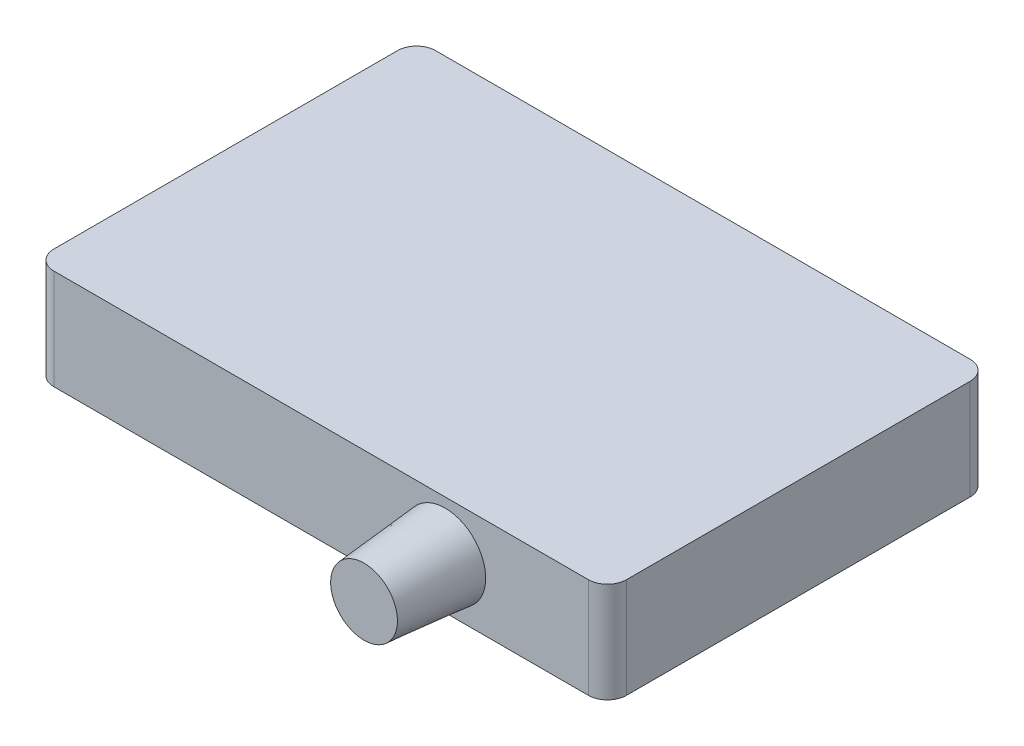
ISO-10303-21;
HEADER;
FILE_DESCRIPTION(('STEP AP214'),'2;1');
FILE_NAME('part.step','',(''),(''),'','','');
FILE_SCHEMA(('AUTOMOTIVE_DESIGN { 1 0 10303 214 1 1 1 1 }'));
ENDSEC;
DATA;
#1=APPLICATION_CONTEXT('core data for automotive mechanical design processes');
#2=APPLICATION_PROTOCOL_DEFINITION('international standard','automotive_design',2000,#1);
#3=PRODUCT_CONTEXT('',#1,'mechanical');
#4=PRODUCT('Part','Part','',(#3));
#5=PRODUCT_RELATED_PRODUCT_CATEGORY('part','',(#4));
#6=PRODUCT_DEFINITION_FORMATION('','',#4);
#7=PRODUCT_DEFINITION_CONTEXT('part definition',#1,'design');
#8=PRODUCT_DEFINITION('design','',#6,#7);
#9=PRODUCT_DEFINITION_SHAPE('','',#8);
#10=(LENGTH_UNIT() NAMED_UNIT(*) SI_UNIT(.MILLI.,.METRE.));
#11=(NAMED_UNIT(*) PLANE_ANGLE_UNIT() SI_UNIT($,.RADIAN.));
#12=(NAMED_UNIT(*) SI_UNIT($,.STERADIAN.) SOLID_ANGLE_UNIT());
#13=UNCERTAINTY_MEASURE_WITH_UNIT(LENGTH_MEASURE(1.E-05),#10,'distance_accuracy_value','');
#14=(GEOMETRIC_REPRESENTATION_CONTEXT(3) GLOBAL_UNCERTAINTY_ASSIGNED_CONTEXT((#13)) GLOBAL_UNIT_ASSIGNED_CONTEXT((#10,
#11,#12)) REPRESENTATION_CONTEXT('',''));
#15=CARTESIAN_POINT('',(0.,0.,0.));
#16=DIRECTION('',(0.,0.,1.));
#17=DIRECTION('',(1.,0.,0.));
#18=AXIS2_PLACEMENT_3D('',#15,#16,#17);
#19=CARTESIAN_POINT('',(-28.,10.5,20.));
#20=DIRECTION('',(0.,0.,-1.));
#21=DIRECTION('',(-1.,0.,0.));
#22=AXIS2_PLACEMENT_3D('',#19,#20,#21);
#23=PLANE('',#22);
#24=DIRECTION('',(1.,0.,0.));
#25=VECTOR('',#24,1.);
#26=CARTESIAN_POINT('',(-28.,0.,20.));
#27=LINE('',#26,#25);
#28=CARTESIAN_POINT('',(-28.,0.,20.));
#29=VERTEX_POINT('',#28);
#30=CARTESIAN_POINT('',(28.,0.,20.));
#31=VERTEX_POINT('',#30);
#32=EDGE_CURVE('E93',#29,#31,#27,.T.);
#33=ORIENTED_EDGE('',*,*,#32,.T.);
#34=DIRECTION('',(0.,-1.,0.));
#35=VECTOR('',#34,1.);
#36=CARTESIAN_POINT('',(28.,10.5,20.));
#37=LINE('',#36,#35);
#38=CARTESIAN_POINT('',(28.,10.5,20.));
#39=VERTEX_POINT('',#38);
#40=EDGE_CURVE('E141',#39,#31,#37,.T.);
#41=ORIENTED_EDGE('',*,*,#40,.F.);
#42=DIRECTION('',(1.,0.,0.));
#43=VECTOR('',#42,1.);
#44=CARTESIAN_POINT('',(-28.,10.5,20.));
#45=LINE('',#44,#43);
#46=CARTESIAN_POINT('',(-28.,10.5,20.));
#47=VERTEX_POINT('',#46);
#48=EDGE_CURVE('E58',#47,#39,#45,.T.);
#49=ORIENTED_EDGE('',*,*,#48,.F.);
#50=DIRECTION('',(0.,-1.,0.));
#51=VECTOR('',#50,1.);
#52=CARTESIAN_POINT('',(-28.,10.5,20.));
#53=LINE('',#52,#51);
#54=EDGE_CURVE('E133',#47,#29,#53,.T.);
#55=ORIENTED_EDGE('',*,*,#54,.T.);
#56=EDGE_LOOP('',(#33,#41,#49,#55));
#57=FACE_BOUND('',#56,.T.);
#58=CARTESIAN_POINT('',(13.,5.25,20.));
#59=DIRECTION('',(0.,0.,-1.));
#60=DIRECTION('',(-1.,0.,0.));
#61=AXIS2_PLACEMENT_3D('',#58,#59,#60);
#62=CIRCLE('',#61,4.24365363997036);
#63=CARTESIAN_POINT('',(8.75634636002963,5.25,20.));
#64=VERTEX_POINT('',#63);
#65=EDGE_CURVE('E11',#64,#64,#62,.F.);
#66=ORIENTED_EDGE('',*,*,#65,.F.);
#67=EDGE_LOOP('',(#66));
#68=FACE_BOUND('',#67,.T.);
#69=ADVANCED_FACE('F40',(#57,#68),#23,.F.);
#70=CARTESIAN_POINT('',(-28.,10.5,-20.));
#71=DIRECTION('',(0.,0.,1.));
#72=DIRECTION('',(1.,0.,0.));
#73=AXIS2_PLACEMENT_3D('',#70,#71,#72);
#74=PLANE('',#73);
#75=CARTESIAN_POINT('',(12.,4.,-20.));
#76=DIRECTION('',(0.,0.,1.));
#77=DIRECTION('',(1.,0.,0.));
#78=AXIS2_PLACEMENT_3D('',#75,#76,#77);
#79=CIRCLE('',#78,2.75);
#80=CARTESIAN_POINT('',(14.75,4.,-20.));
#81=VERTEX_POINT('',#80);
#82=EDGE_CURVE('E193',#81,#81,#79,.F.);
#83=ORIENTED_EDGE('',*,*,#82,.F.);
#84=EDGE_LOOP('',(#83));
#85=FACE_BOUND('',#84,.T.);
#86=DIRECTION('',(-1.,0.,0.));
#87=VECTOR('',#86,1.);
#88=CARTESIAN_POINT('',(-28.,0.,-20.));
#89=LINE('',#88,#87);
#90=CARTESIAN_POINT('',(28.,0.,-20.));
#91=VERTEX_POINT('',#90);
#92=CARTESIAN_POINT('',(-28.,0.,-20.));
#93=VERTEX_POINT('',#92);
#94=EDGE_CURVE('E156',#91,#93,#89,.T.);
#95=ORIENTED_EDGE('',*,*,#94,.T.);
#96=DIRECTION('',(0.,-1.,0.));
#97=VECTOR('',#96,1.);
#98=CARTESIAN_POINT('',(-28.,10.5,-20.));
#99=LINE('',#98,#97);
#100=CARTESIAN_POINT('',(-28.,10.5,-20.));
#101=VERTEX_POINT('',#100);
#102=EDGE_CURVE('E174',#101,#93,#99,.T.);
#103=ORIENTED_EDGE('',*,*,#102,.F.);
#104=DIRECTION('',(-1.,0.,0.));
#105=VECTOR('',#104,1.);
#106=CARTESIAN_POINT('',(-28.,10.5,-20.));
#107=LINE('',#106,#105);
#108=CARTESIAN_POINT('',(28.,10.5,-20.));
#109=VERTEX_POINT('',#108);
#110=EDGE_CURVE('E268',#109,#101,#107,.T.);
#111=ORIENTED_EDGE('',*,*,#110,.F.);
#112=DIRECTION('',(0.,-1.,0.));
#113=VECTOR('',#112,1.);
#114=CARTESIAN_POINT('',(28.,10.5,-20.));
#115=LINE('',#114,#113);
#116=EDGE_CURVE('E178',#109,#91,#115,.T.);
#117=ORIENTED_EDGE('',*,*,#116,.T.);
#118=EDGE_LOOP('',(#95,#103,#111,#117));
#119=FACE_BOUND('',#118,.T.);
#120=CARTESIAN_POINT('',(18.,4.,-20.));
#121=DIRECTION('',(0.,0.,1.));
#122=DIRECTION('',(1.,0.,0.));
#123=AXIS2_PLACEMENT_3D('',#120,#121,#122);
#124=CIRCLE('',#123,2.75);
#125=CARTESIAN_POINT('',(20.75,4.,-20.));
#126=VERTEX_POINT('',#125);
#127=EDGE_CURVE('E189',#126,#126,#124,.F.);
#128=ORIENTED_EDGE('',*,*,#127,.F.);
#129=EDGE_LOOP('',(#128));
#130=FACE_BOUND('',#129,.T.);
#131=CARTESIAN_POINT('',(5.99999999999999,4.,-20.));
#132=DIRECTION('',(0.,0.,1.));
#133=DIRECTION('',(1.,0.,0.));
#134=AXIS2_PLACEMENT_3D('',#131,#132,#133);
#135=CIRCLE('',#134,2.75);
#136=CARTESIAN_POINT('',(8.74999999999999,4.,-20.));
#137=VERTEX_POINT('',#136);
#138=EDGE_CURVE('E197',#137,#137,#135,.F.);
#139=ORIENTED_EDGE('',*,*,#138,.F.);
#140=EDGE_LOOP('',(#139));
#141=FACE_BOUND('',#140,.T.);
#142=ADVANCED_FACE('F276',(#85,#119,#130,#141),#74,.F.);
#143=CARTESIAN_POINT('',(28.,10.5,18.));
#144=DIRECTION('',(0.,-1.,0.));
#145=DIRECTION('',(0.,0.,-1.));
#146=AXIS2_PLACEMENT_3D('',#143,#144,#145);
#147=CYLINDRICAL_SURFACE('',#146,2.);
#148=CARTESIAN_POINT('',(28.,0.,18.));
#149=DIRECTION('',(0.,1.,0.));
#150=DIRECTION('',(0.,0.,1.));
#151=AXIS2_PLACEMENT_3D('',#148,#149,#150);
#152=CIRCLE('',#151,2.);
#153=CARTESIAN_POINT('',(30.,0.,18.));
#154=VERTEX_POINT('',#153);
#155=EDGE_CURVE('E145',#31,#154,#152,.T.);
#156=ORIENTED_EDGE('',*,*,#155,.T.);
#157=DIRECTION('',(0.,-1.,0.));
#158=VECTOR('',#157,1.);
#159=CARTESIAN_POINT('',(30.,10.5,18.));
#160=LINE('',#159,#158);
#161=CARTESIAN_POINT('',(30.,10.5,18.));
#162=VERTEX_POINT('',#161);
#163=EDGE_CURVE('E186',#162,#154,#160,.T.);
#164=ORIENTED_EDGE('',*,*,#163,.F.);
#165=CARTESIAN_POINT('',(28.,10.5,18.));
#166=DIRECTION('',(0.,1.,0.));
#167=DIRECTION('',(0.,0.,1.));
#168=AXIS2_PLACEMENT_3D('',#165,#166,#167);
#169=CIRCLE('',#168,2.);
#170=EDGE_CURVE('E168',#39,#162,#169,.T.);
#171=ORIENTED_EDGE('',*,*,#170,.F.);
#172=ORIENTED_EDGE('',*,*,#40,.T.);
#173=EDGE_LOOP('',(#156,#164,#171,#172));
#174=FACE_BOUND('',#173,.T.);
#175=ADVANCED_FACE('F287',(#174),#147,.T.);
#176=CARTESIAN_POINT('',(30.,10.5,-18.));
#177=DIRECTION('',(-1.,0.,0.));
#178=DIRECTION('',(0.,0.,1.));
#179=AXIS2_PLACEMENT_3D('',#176,#177,#178);
#180=PLANE('',#179);
#181=DIRECTION('',(0.,0.,-1.));
#182=VECTOR('',#181,1.);
#183=CARTESIAN_POINT('',(30.,0.,-18.));
#184=LINE('',#183,#182);
#185=CARTESIAN_POINT('',(30.,0.,-18.));
#186=VERTEX_POINT('',#185);
#187=EDGE_CURVE('E149',#154,#186,#184,.T.);
#188=ORIENTED_EDGE('',*,*,#187,.T.);
#189=DIRECTION('',(0.,-1.,0.));
#190=VECTOR('',#189,1.);
#191=CARTESIAN_POINT('',(30.,10.5,-18.));
#192=LINE('',#191,#190);
#193=CARTESIAN_POINT('',(30.,10.5,-18.));
#194=VERTEX_POINT('',#193);
#195=EDGE_CURVE('E182',#194,#186,#192,.T.);
#196=ORIENTED_EDGE('',*,*,#195,.F.);
#197=DIRECTION('',(0.,0.,-1.));
#198=VECTOR('',#197,1.);
#199=CARTESIAN_POINT('',(30.,10.5,-18.));
#200=LINE('',#199,#198);
#201=EDGE_CURVE('E102',#162,#194,#200,.T.);
#202=ORIENTED_EDGE('',*,*,#201,.F.);
#203=ORIENTED_EDGE('',*,*,#163,.T.);
#204=EDGE_LOOP('',(#188,#196,#202,#203));
#205=FACE_BOUND('',#204,.T.);
#206=ADVANCED_FACE('F374',(#205),#180,.F.);
#207=CARTESIAN_POINT('',(28.,10.5,-18.));
#208=DIRECTION('',(0.,-1.,0.));
#209=DIRECTION('',(0.,0.,-1.));
#210=AXIS2_PLACEMENT_3D('',#207,#208,#209);
#211=CYLINDRICAL_SURFACE('',#210,2.);
#212=CARTESIAN_POINT('',(28.,0.,-18.));
#213=DIRECTION('',(0.,1.,0.));
#214=DIRECTION('',(0.,0.,1.));
#215=AXIS2_PLACEMENT_3D('',#212,#213,#214);
#216=CIRCLE('',#215,2.);
#217=EDGE_CURVE('E153',#186,#91,#216,.T.);
#218=ORIENTED_EDGE('',*,*,#217,.T.);
#219=ORIENTED_EDGE('',*,*,#116,.F.);
#220=CARTESIAN_POINT('',(28.,10.5,-18.));
#221=DIRECTION('',(0.,1.,0.));
#222=DIRECTION('',(0.,0.,1.));
#223=AXIS2_PLACEMENT_3D('',#220,#221,#222);
#224=CIRCLE('',#223,2.);
#225=EDGE_CURVE('E265',#194,#109,#224,.T.);
#226=ORIENTED_EDGE('',*,*,#225,.F.);
#227=ORIENTED_EDGE('',*,*,#195,.T.);
#228=EDGE_LOOP('',(#218,#219,#226,#227));
#229=FACE_BOUND('',#228,.T.);
#230=ADVANCED_FACE('F368',(#229),#211,.T.);
#231=CARTESIAN_POINT('',(-28.,10.5,-18.));
#232=DIRECTION('',(0.,-1.,0.));
#233=DIRECTION('',(0.,0.,-1.));
#234=AXIS2_PLACEMENT_3D('',#231,#232,#233);
#235=CYLINDRICAL_SURFACE('',#234,2.);
#236=CARTESIAN_POINT('',(-28.,0.,-18.));
#237=DIRECTION('',(0.,1.,0.));
#238=DIRECTION('',(0.,0.,1.));
#239=AXIS2_PLACEMENT_3D('',#236,#237,#238);
#240=CIRCLE('',#239,2.);
#241=CARTESIAN_POINT('',(-30.,0.,-18.));
#242=VERTEX_POINT('',#241);
#243=EDGE_CURVE('E159',#93,#242,#240,.T.);
#244=ORIENTED_EDGE('',*,*,#243,.T.);
#245=DIRECTION('',(0.,-1.,0.));
#246=VECTOR('',#245,1.);
#247=CARTESIAN_POINT('',(-30.,10.5,-18.));
#248=LINE('',#247,#246);
#249=CARTESIAN_POINT('',(-30.,10.5,-18.));
#250=VERTEX_POINT('',#249);
#251=EDGE_CURVE('E132',#250,#242,#248,.T.);
#252=ORIENTED_EDGE('',*,*,#251,.F.);
#253=CARTESIAN_POINT('',(-28.,10.5,-18.));
#254=DIRECTION('',(0.,1.,0.));
#255=DIRECTION('',(0.,0.,1.));
#256=AXIS2_PLACEMENT_3D('',#253,#254,#255);
#257=CIRCLE('',#256,2.);
#258=EDGE_CURVE('E121',#101,#250,#257,.T.);
#259=ORIENTED_EDGE('',*,*,#258,.F.);
#260=ORIENTED_EDGE('',*,*,#102,.T.);
#261=EDGE_LOOP('',(#244,#252,#259,#260));
#262=FACE_BOUND('',#261,.T.);
#263=ADVANCED_FACE('F281',(#262),#235,.T.);
#264=CARTESIAN_POINT('',(-30.,10.5,-18.));
#265=DIRECTION('',(1.,0.,0.));
#266=DIRECTION('',(0.,0.,-1.));
#267=AXIS2_PLACEMENT_3D('',#264,#265,#266);
#268=PLANE('',#267);
#269=DIRECTION('',(0.,0.,1.));
#270=VECTOR('',#269,1.);
#271=CARTESIAN_POINT('',(-30.,0.,-18.));
#272=LINE('',#271,#270);
#273=CARTESIAN_POINT('',(-30.,0.,18.));
#274=VERTEX_POINT('',#273);
#275=EDGE_CURVE('E130',#242,#274,#272,.T.);
#276=ORIENTED_EDGE('',*,*,#275,.T.);
#277=DIRECTION('',(0.,-1.,0.));
#278=VECTOR('',#277,1.);
#279=CARTESIAN_POINT('',(-30.,10.5,18.));
#280=LINE('',#279,#278);
#281=CARTESIAN_POINT('',(-30.,10.5,18.));
#282=VERTEX_POINT('',#281);
#283=EDGE_CURVE('E127',#282,#274,#280,.T.);
#284=ORIENTED_EDGE('',*,*,#283,.F.);
#285=DIRECTION('',(0.,0.,1.));
#286=VECTOR('',#285,1.);
#287=CARTESIAN_POINT('',(-30.,10.5,-18.));
#288=LINE('',#287,#286);
#289=EDGE_CURVE('E115',#250,#282,#288,.T.);
#290=ORIENTED_EDGE('',*,*,#289,.F.);
#291=ORIENTED_EDGE('',*,*,#251,.T.);
#292=EDGE_LOOP('',(#276,#284,#290,#291));
#293=FACE_BOUND('',#292,.T.);
#294=ADVANCED_FACE('F128',(#293),#268,.F.);
#295=CARTESIAN_POINT('',(-28.,10.5,18.));
#296=DIRECTION('',(0.,-1.,0.));
#297=DIRECTION('',(0.,0.,-1.));
#298=AXIS2_PLACEMENT_3D('',#295,#296,#297);
#299=CYLINDRICAL_SURFACE('',#298,2.);
#300=CARTESIAN_POINT('',(-28.,0.,18.));
#301=DIRECTION('',(0.,1.,0.));
#302=DIRECTION('',(0.,0.,-1.));
#303=AXIS2_PLACEMENT_3D('',#300,#301,#302);
#304=CIRCLE('',#303,2.);
#305=EDGE_CURVE('E87',#274,#29,#304,.T.);
#306=ORIENTED_EDGE('',*,*,#305,.T.);
#307=ORIENTED_EDGE('',*,*,#54,.F.);
#308=CARTESIAN_POINT('',(-28.,10.5,18.));
#309=DIRECTION('',(0.,1.,0.));
#310=DIRECTION('',(0.,0.,-1.));
#311=AXIS2_PLACEMENT_3D('',#308,#309,#310);
#312=CIRCLE('',#311,2.);
#313=EDGE_CURVE('E119',#282,#47,#312,.T.);
#314=ORIENTED_EDGE('',*,*,#313,.F.);
#315=ORIENTED_EDGE('',*,*,#283,.T.);
#316=EDGE_LOOP('',(#306,#307,#314,#315));
#317=FACE_BOUND('',#316,.T.);
#318=ADVANCED_FACE('F135',(#317),#299,.T.);
#319=CARTESIAN_POINT('',(28.,10.5,18.));
#320=DIRECTION('',(0.,1.,0.));
#321=DIRECTION('',(0.,0.,1.));
#322=AXIS2_PLACEMENT_3D('',#319,#320,#321);
#323=PLANE('',#322);
#324=ORIENTED_EDGE('',*,*,#170,.T.);
#325=ORIENTED_EDGE('',*,*,#201,.T.);
#326=ORIENTED_EDGE('',*,*,#225,.T.);
#327=ORIENTED_EDGE('',*,*,#110,.T.);
#328=ORIENTED_EDGE('',*,*,#258,.T.);
#329=ORIENTED_EDGE('',*,*,#289,.T.);
#330=ORIENTED_EDGE('',*,*,#313,.T.);
#331=ORIENTED_EDGE('',*,*,#48,.T.);
#332=EDGE_LOOP('',(#324,#325,#326,#327,#328,#329,#330,#331));
#333=FACE_BOUND('',#332,.T.);
#334=ADVANCED_FACE('F117',(#333),#323,.T.);
#335=CARTESIAN_POINT('',(28.,0.,18.));
#336=DIRECTION('',(0.,1.,0.));
#337=DIRECTION('',(0.,0.,1.));
#338=AXIS2_PLACEMENT_3D('',#335,#336,#337);
#339=PLANE('',#338);
#340=ORIENTED_EDGE('',*,*,#155,.F.);
#341=ORIENTED_EDGE('',*,*,#32,.F.);
#342=ORIENTED_EDGE('',*,*,#305,.F.);
#343=ORIENTED_EDGE('',*,*,#275,.F.);
#344=ORIENTED_EDGE('',*,*,#243,.F.);
#345=ORIENTED_EDGE('',*,*,#94,.F.);
#346=ORIENTED_EDGE('',*,*,#217,.F.);
#347=ORIENTED_EDGE('',*,*,#187,.F.);
#348=EDGE_LOOP('',(#340,#341,#342,#343,#344,#345,#346,#347));
#349=FACE_BOUND('',#348,.T.);
#350=ADVANCED_FACE('F235',(#349),#339,.F.);
#351=CARTESIAN_POINT('',(18.,4.,-20.5));
#352=DIRECTION('',(0.,0.,-1.));
#353=DIRECTION('',(-1.,0.,0.));
#354=AXIS2_PLACEMENT_3D('',#351,#352,#353);
#355=PLANE('',#354);
#356=CARTESIAN_POINT('',(18.,4.,-20.5));
#357=DIRECTION('',(0.,0.,-1.));
#358=DIRECTION('',(-1.,0.,0.));
#359=AXIS2_PLACEMENT_3D('',#356,#357,#358);
#360=CIRCLE('',#359,2.5);
#361=CARTESIAN_POINT('',(15.5,4.,-20.5));
#362=VERTEX_POINT('',#361);
#363=EDGE_CURVE('E216',#362,#362,#360,.T.);
#364=ORIENTED_EDGE('',*,*,#363,.T.);
#365=EDGE_LOOP('',(#364));
#366=FACE_BOUND('',#365,.T.);
#367=CARTESIAN_POINT('',(18.,4.,-20.5));
#368=DIRECTION('',(0.,0.,-1.));
#369=DIRECTION('',(-1.,0.,0.));
#370=AXIS2_PLACEMENT_3D('',#367,#368,#369);
#371=CIRCLE('',#370,2.25);
#372=CARTESIAN_POINT('',(15.75,4.,-20.5));
#373=VERTEX_POINT('',#372);
#374=EDGE_CURVE('E239',#373,#373,#371,.T.);
#375=ORIENTED_EDGE('',*,*,#374,.F.);
#376=EDGE_LOOP('',(#375));
#377=FACE_BOUND('',#376,.T.);
#378=ADVANCED_FACE('F232',(#366,#377),#355,.T.);
#379=CARTESIAN_POINT('',(18.,4.,-20.5));
#380=DIRECTION('',(0.,0.,1.));
#381=DIRECTION('',(1.,0.,0.));
#382=AXIS2_PLACEMENT_3D('',#379,#380,#381);
#383=CYLINDRICAL_SURFACE('',#382,2.75);
#384=CARTESIAN_POINT('',(18.,4.,-20.25));
#385=DIRECTION('',(0.,0.,-1.));
#386=DIRECTION('',(-1.,0.,0.));
#387=AXIS2_PLACEMENT_3D('',#384,#385,#386);
#388=CIRCLE('',#387,2.75);
#389=CARTESIAN_POINT('',(15.25,4.,-20.25));
#390=VERTEX_POINT('',#389);
#391=EDGE_CURVE('E50',#390,#390,#388,.F.);
#392=ORIENTED_EDGE('',*,*,#391,.T.);
#393=EDGE_LOOP('',(#392));
#394=FACE_BOUND('',#393,.T.);
#395=ORIENTED_EDGE('',*,*,#127,.T.);
#396=EDGE_LOOP('',(#395));
#397=FACE_BOUND('',#396,.T.);
#398=ADVANCED_FACE('F223',(#394,#397),#383,.T.);
#399=CARTESIAN_POINT('',(18.,4.,-16.));
#400=DIRECTION('',(0.,0.,-1.));
#401=DIRECTION('',(-1.,0.,0.));
#402=AXIS2_PLACEMENT_3D('',#399,#400,#401);
#403=PLANE('',#402);
#404=CARTESIAN_POINT('',(18.,4.,-16.));
#405=DIRECTION('',(0.,0.,-1.));
#406=DIRECTION('',(-1.,0.,0.));
#407=AXIS2_PLACEMENT_3D('',#404,#405,#406);
#408=CIRCLE('',#407,2.25);
#409=CARTESIAN_POINT('',(15.75,4.,-16.));
#410=VERTEX_POINT('',#409);
#411=EDGE_CURVE('E150',#410,#410,#408,.T.);
#412=ORIENTED_EDGE('',*,*,#411,.T.);
#413=EDGE_LOOP('',(#412));
#414=FACE_BOUND('',#413,.T.);
#415=ADVANCED_FACE('F341',(#414),#403,.T.);
#416=CARTESIAN_POINT('',(18.,4.,-16.));
#417=DIRECTION('',(0.,0.,-1.));
#418=DIRECTION('',(-1.,0.,0.));
#419=AXIS2_PLACEMENT_3D('',#416,#417,#418);
#420=CYLINDRICAL_SURFACE('',#419,2.25);
#421=ORIENTED_EDGE('',*,*,#411,.F.);
#422=EDGE_LOOP('',(#421));
#423=FACE_BOUND('',#422,.T.);
#424=ORIENTED_EDGE('',*,*,#374,.T.);
#425=EDGE_LOOP('',(#424));
#426=FACE_BOUND('',#425,.T.);
#427=ADVANCED_FACE('F334',(#423,#426),#420,.F.);
#428=CARTESIAN_POINT('',(12.,4.,-20.5));
#429=DIRECTION('',(0.,0.,-1.));
#430=DIRECTION('',(-1.,0.,0.));
#431=AXIS2_PLACEMENT_3D('',#428,#429,#430);
#432=PLANE('',#431);
#433=CARTESIAN_POINT('',(12.,4.,-20.5));
#434=DIRECTION('',(0.,0.,-1.));
#435=DIRECTION('',(-1.,0.,0.));
#436=AXIS2_PLACEMENT_3D('',#433,#434,#435);
#437=CIRCLE('',#436,2.49999999999999);
#438=CARTESIAN_POINT('',(9.5,4.,-20.5));
#439=VERTEX_POINT('',#438);
#440=EDGE_CURVE('E209',#439,#439,#437,.T.);
#441=ORIENTED_EDGE('',*,*,#440,.T.);
#442=EDGE_LOOP('',(#441));
#443=FACE_BOUND('',#442,.T.);
#444=CARTESIAN_POINT('',(12.,4.,-20.5));
#445=DIRECTION('',(0.,0.,-1.));
#446=DIRECTION('',(-1.,0.,0.));
#447=AXIS2_PLACEMENT_3D('',#444,#445,#446);
#448=CIRCLE('',#447,2.25);
#449=CARTESIAN_POINT('',(9.74999999999999,4.,-20.5));
#450=VERTEX_POINT('',#449);
#451=EDGE_CURVE('E243',#450,#450,#448,.T.);
#452=ORIENTED_EDGE('',*,*,#451,.F.);
#453=EDGE_LOOP('',(#452));
#454=FACE_BOUND('',#453,.T.);
#455=ADVANCED_FACE('F330',(#443,#454),#432,.T.);
#456=CARTESIAN_POINT('',(12.,4.,-20.5));
#457=DIRECTION('',(0.,0.,1.));
#458=DIRECTION('',(1.,0.,0.));
#459=AXIS2_PLACEMENT_3D('',#456,#457,#458);
#460=CYLINDRICAL_SURFACE('',#459,2.75);
#461=CARTESIAN_POINT('',(12.,4.,-20.25));
#462=DIRECTION('',(0.,0.,-1.));
#463=DIRECTION('',(-1.,0.,0.));
#464=AXIS2_PLACEMENT_3D('',#461,#462,#463);
#465=CIRCLE('',#464,2.75);
#466=CARTESIAN_POINT('',(9.24999999999999,4.,-20.25));
#467=VERTEX_POINT('',#466);
#468=EDGE_CURVE('E213',#467,#467,#465,.F.);
#469=ORIENTED_EDGE('',*,*,#468,.T.);
#470=EDGE_LOOP('',(#469));
#471=FACE_BOUND('',#470,.T.);
#472=ORIENTED_EDGE('',*,*,#82,.T.);
#473=EDGE_LOOP('',(#472));
#474=FACE_BOUND('',#473,.T.);
#475=ADVANCED_FACE('F333',(#471,#474),#460,.T.);
#476=CARTESIAN_POINT('',(12.,4.,-16.));
#477=DIRECTION('',(0.,0.,-1.));
#478=DIRECTION('',(-1.,0.,0.));
#479=AXIS2_PLACEMENT_3D('',#476,#477,#478);
#480=PLANE('',#479);
#481=CARTESIAN_POINT('',(12.,4.,-16.));
#482=DIRECTION('',(0.,0.,-1.));
#483=DIRECTION('',(-1.,0.,0.));
#484=AXIS2_PLACEMENT_3D('',#481,#482,#483);
#485=CIRCLE('',#484,2.25);
#486=CARTESIAN_POINT('',(9.74999999999999,4.,-16.));
#487=VERTEX_POINT('',#486);
#488=EDGE_CURVE('E247',#487,#487,#485,.T.);
#489=ORIENTED_EDGE('',*,*,#488,.T.);
#490=EDGE_LOOP('',(#489));
#491=FACE_BOUND('',#490,.T.);
#492=ADVANCED_FACE('F326',(#491),#480,.T.);
#493=CARTESIAN_POINT('',(12.,4.,-16.));
#494=DIRECTION('',(0.,0.,-1.));
#495=DIRECTION('',(-1.,0.,0.));
#496=AXIS2_PLACEMENT_3D('',#493,#494,#495);
#497=CYLINDRICAL_SURFACE('',#496,2.25);
#498=ORIENTED_EDGE('',*,*,#488,.F.);
#499=EDGE_LOOP('',(#498));
#500=FACE_BOUND('',#499,.T.);
#501=ORIENTED_EDGE('',*,*,#451,.T.);
#502=EDGE_LOOP('',(#501));
#503=FACE_BOUND('',#502,.T.);
#504=ADVANCED_FACE('F316',(#500,#503),#497,.F.);
#505=CARTESIAN_POINT('',(5.99999999999999,4.,-20.5));
#506=DIRECTION('',(0.,0.,-1.));
#507=DIRECTION('',(-1.,0.,0.));
#508=AXIS2_PLACEMENT_3D('',#505,#506,#507);
#509=PLANE('',#508);
#510=CARTESIAN_POINT('',(5.99999999999999,4.,-20.5));
#511=DIRECTION('',(0.,0.,-1.));
#512=DIRECTION('',(-1.,0.,0.));
#513=AXIS2_PLACEMENT_3D('',#510,#511,#512);
#514=CIRCLE('',#513,2.49999999999999);
#515=CARTESIAN_POINT('',(3.5,4.,-20.5));
#516=VERTEX_POINT('',#515);
#517=EDGE_CURVE('E201',#516,#516,#514,.T.);
#518=ORIENTED_EDGE('',*,*,#517,.T.);
#519=EDGE_LOOP('',(#518));
#520=FACE_BOUND('',#519,.T.);
#521=CARTESIAN_POINT('',(5.99999999999999,4.,-20.5));
#522=DIRECTION('',(0.,0.,-1.));
#523=DIRECTION('',(-1.,0.,0.));
#524=AXIS2_PLACEMENT_3D('',#521,#522,#523);
#525=CIRCLE('',#524,2.25);
#526=CARTESIAN_POINT('',(3.74999999999999,4.,-20.5));
#527=VERTEX_POINT('',#526);
#528=EDGE_CURVE('E251',#527,#527,#525,.T.);
#529=ORIENTED_EDGE('',*,*,#528,.F.);
#530=EDGE_LOOP('',(#529));
#531=FACE_BOUND('',#530,.T.);
#532=ADVANCED_FACE('F313',(#520,#531),#509,.T.);
#533=CARTESIAN_POINT('',(5.99999999999999,4.,-20.5));
#534=DIRECTION('',(0.,0.,1.));
#535=DIRECTION('',(1.,0.,0.));
#536=AXIS2_PLACEMENT_3D('',#533,#534,#535);
#537=CYLINDRICAL_SURFACE('',#536,2.75);
#538=CARTESIAN_POINT('',(5.99999999999999,4.,-20.25));
#539=DIRECTION('',(0.,0.,-1.));
#540=DIRECTION('',(-1.,0.,0.));
#541=AXIS2_PLACEMENT_3D('',#538,#539,#540);
#542=CIRCLE('',#541,2.75);
#543=CARTESIAN_POINT('',(3.24999999999999,4.,-20.25));
#544=VERTEX_POINT('',#543);
#545=EDGE_CURVE('E205',#544,#544,#542,.F.);
#546=ORIENTED_EDGE('',*,*,#545,.T.);
#547=EDGE_LOOP('',(#546));
#548=FACE_BOUND('',#547,.T.);
#549=ORIENTED_EDGE('',*,*,#138,.T.);
#550=EDGE_LOOP('',(#549));
#551=FACE_BOUND('',#550,.T.);
#552=ADVANCED_FACE('F315',(#548,#551),#537,.T.);
#553=CARTESIAN_POINT('',(5.99999999999999,4.,-16.));
#554=DIRECTION('',(0.,0.,-1.));
#555=DIRECTION('',(-1.,0.,0.));
#556=AXIS2_PLACEMENT_3D('',#553,#554,#555);
#557=PLANE('',#556);
#558=CARTESIAN_POINT('',(5.99999999999999,4.,-16.));
#559=DIRECTION('',(0.,0.,-1.));
#560=DIRECTION('',(-1.,0.,0.));
#561=AXIS2_PLACEMENT_3D('',#558,#559,#560);
#562=CIRCLE('',#561,2.25);
#563=CARTESIAN_POINT('',(3.74999999999999,4.,-16.));
#564=VERTEX_POINT('',#563);
#565=EDGE_CURVE('E242',#564,#564,#562,.T.);
#566=ORIENTED_EDGE('',*,*,#565,.T.);
#567=EDGE_LOOP('',(#566));
#568=FACE_BOUND('',#567,.T.);
#569=ADVANCED_FACE('F323',(#568),#557,.T.);
#570=CARTESIAN_POINT('',(5.99999999999999,4.,-16.));
#571=DIRECTION('',(0.,0.,-1.));
#572=DIRECTION('',(-1.,0.,0.));
#573=AXIS2_PLACEMENT_3D('',#570,#571,#572);
#574=CYLINDRICAL_SURFACE('',#573,2.25);
#575=ORIENTED_EDGE('',*,*,#565,.F.);
#576=EDGE_LOOP('',(#575));
#577=FACE_BOUND('',#576,.T.);
#578=ORIENTED_EDGE('',*,*,#528,.T.);
#579=EDGE_LOOP('',(#578));
#580=FACE_BOUND('',#579,.T.);
#581=ADVANCED_FACE('F311',(#577,#580),#574,.F.);
#582=CARTESIAN_POINT('',(5.99999999999999,4.,-20.5));
#583=DIRECTION('',(0.,0.,1.));
#584=DIRECTION('',(1.,0.,0.));
#585=AXIS2_PLACEMENT_3D('',#582,#583,#584);
#586=CONICAL_SURFACE('',#585,2.49999999999999,0.785398163397434);
#587=ORIENTED_EDGE('',*,*,#545,.F.);
#588=EDGE_LOOP('',(#587));
#589=FACE_BOUND('',#588,.T.);
#590=ORIENTED_EDGE('',*,*,#517,.F.);
#591=EDGE_LOOP('',(#590));
#592=FACE_BOUND('',#591,.T.);
#593=ADVANCED_FACE('F347',(#589,#592),#586,.T.);
#594=CARTESIAN_POINT('',(12.,4.,-20.5));
#595=DIRECTION('',(0.,0.,1.));
#596=DIRECTION('',(1.,0.,0.));
#597=AXIS2_PLACEMENT_3D('',#594,#595,#596);
#598=CONICAL_SURFACE('',#597,2.49999999999999,0.785398163397434);
#599=ORIENTED_EDGE('',*,*,#468,.F.);
#600=EDGE_LOOP('',(#599));
#601=FACE_BOUND('',#600,.T.);
#602=ORIENTED_EDGE('',*,*,#440,.F.);
#603=EDGE_LOOP('',(#602));
#604=FACE_BOUND('',#603,.T.);
#605=ADVANCED_FACE('F229',(#601,#604),#598,.T.);
#606=CARTESIAN_POINT('',(18.,4.,-20.5));
#607=DIRECTION('',(0.,0.,1.));
#608=DIRECTION('',(1.,0.,0.));
#609=AXIS2_PLACEMENT_3D('',#606,#607,#608);
#610=CONICAL_SURFACE('',#609,2.5,0.785398163397455);
#611=ORIENTED_EDGE('',*,*,#391,.F.);
#612=EDGE_LOOP('',(#611));
#613=FACE_BOUND('',#612,.T.);
#614=ORIENTED_EDGE('',*,*,#363,.F.);
#615=EDGE_LOOP('',(#614));
#616=FACE_BOUND('',#615,.T.);
#617=ADVANCED_FACE('F226',(#613,#616),#610,.T.);
#618=CARTESIAN_POINT('',(13.,5.25,28.5));
#619=DIRECTION('',(0.,0.,-1.));
#620=DIRECTION('',(1.,0.,0.));
#621=AXIS2_PLACEMENT_3D('',#618,#619,#620);
#622=CONICAL_SURFACE('',#621,3.5,0.0872664625997169);
#623=CARTESIAN_POINT('',(13.,5.25,28.5));
#624=DIRECTION('',(0.,0.,1.));
#625=DIRECTION('',(1.,0.,0.));
#626=AXIS2_PLACEMENT_3D('',#623,#624,#625);
#627=CIRCLE('',#626,3.5);
#628=CARTESIAN_POINT('',(16.5,5.25,28.5));
#629=VERTEX_POINT('',#628);
#630=EDGE_CURVE('E304',#629,#629,#627,.T.);
#631=ORIENTED_EDGE('',*,*,#630,.F.);
#632=EDGE_LOOP('',(#631));
#633=FACE_BOUND('',#632,.T.);
#634=ORIENTED_EDGE('',*,*,#65,.T.);
#635=EDGE_LOOP('',(#634));
#636=FACE_BOUND('',#635,.T.);
#637=ADVANCED_FACE('F42',(#633,#636),#622,.T.);
#638=CARTESIAN_POINT('',(13.,5.25,28.5));
#639=DIRECTION('',(0.,0.,1.));
#640=DIRECTION('',(1.,0.,0.));
#641=AXIS2_PLACEMENT_3D('',#638,#639,#640);
#642=PLANE('',#641);
#643=ORIENTED_EDGE('',*,*,#630,.T.);
#644=EDGE_LOOP('',(#643));
#645=FACE_BOUND('',#644,.T.);
#646=ADVANCED_FACE('F295',(#645),#642,.T.);
#647=CLOSED_SHELL('',(#69,#142,#175,#206,#230,#263,#294,#318,#334,#350,#378,#398,#415,#427,#455,
#475,#492,#504,#532,#552,#569,#581,#593,#605,#617,#637,#646));
#648=MANIFOLD_SOLID_BREP('B2',#647);
#649=ADVANCED_BREP_SHAPE_REPRESENTATION('',(#18,#648),#14);
#650=SHAPE_DEFINITION_REPRESENTATION(#9,#649);
ENDSEC;
END-ISO-10303-21;
